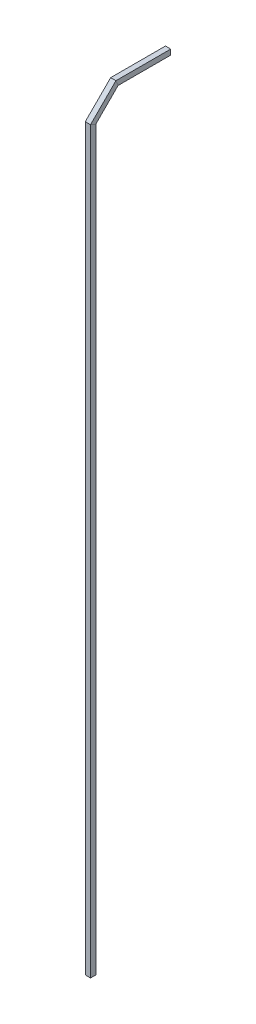
ISO-10303-21;
HEADER;
FILE_DESCRIPTION(('STEP AP214'),'2;1');
FILE_NAME('part.step','',(''),(''),'','','');
FILE_SCHEMA(('AUTOMOTIVE_DESIGN { 1 0 10303 214 1 1 1 1 }'));
ENDSEC;
DATA;
#1=APPLICATION_CONTEXT('core data for automotive mechanical design processes');
#2=APPLICATION_PROTOCOL_DEFINITION('international standard','automotive_design',2000,#1);
#3=PRODUCT_CONTEXT('',#1,'mechanical');
#4=PRODUCT('Part','Part','',(#3));
#5=PRODUCT_RELATED_PRODUCT_CATEGORY('part','',(#4));
#6=PRODUCT_DEFINITION_FORMATION('','',#4);
#7=PRODUCT_DEFINITION_CONTEXT('part definition',#1,'design');
#8=PRODUCT_DEFINITION('design','',#6,#7);
#9=PRODUCT_DEFINITION_SHAPE('','',#8);
#10=(LENGTH_UNIT() NAMED_UNIT(*) SI_UNIT(.MILLI.,.METRE.));
#11=(NAMED_UNIT(*) PLANE_ANGLE_UNIT() SI_UNIT($,.RADIAN.));
#12=(NAMED_UNIT(*) SI_UNIT($,.STERADIAN.) SOLID_ANGLE_UNIT());
#13=UNCERTAINTY_MEASURE_WITH_UNIT(LENGTH_MEASURE(1.E-05),#10,'distance_accuracy_value','');
#14=(GEOMETRIC_REPRESENTATION_CONTEXT(3) GLOBAL_UNCERTAINTY_ASSIGNED_CONTEXT((#13)) GLOBAL_UNIT_ASSIGNED_CONTEXT((#10,
#11,#12)) REPRESENTATION_CONTEXT('',''));
#15=CARTESIAN_POINT('',(0.,0.,0.));
#16=DIRECTION('',(0.,0.,1.));
#17=DIRECTION('',(1.,0.,0.));
#18=AXIS2_PLACEMENT_3D('',#15,#16,#17);
#19=CARTESIAN_POINT('',(0.,1447.42640687119,-147.426406871193));
#20=DIRECTION('',(0.,0.,-1.));
#21=DIRECTION('',(0.,1.,0.));
#22=AXIS2_PLACEMENT_3D('',#19,#20,#21);
#23=PLANE('',#22);
#24=DIRECTION('',(0.,1.,0.));
#25=VECTOR('',#24,1.);
#26=CARTESIAN_POINT('',(-5.,1442.42640687119,-147.426406871193));
#27=LINE('',#26,#25);
#28=CARTESIAN_POINT('',(-5.,1442.42640687119,-147.426406871193));
#29=VERTEX_POINT('',#28);
#30=CARTESIAN_POINT('',(-5.,1452.42640687119,-147.426406871193));
#31=VERTEX_POINT('',#30);
#32=EDGE_CURVE('E80',#29,#31,#27,.T.);
#33=ORIENTED_EDGE('',*,*,#32,.T.);
#34=DIRECTION('',(1.,0.,0.));
#35=VECTOR('',#34,1.);
#36=CARTESIAN_POINT('',(-5.,1452.42640687119,-147.426406871193));
#37=LINE('',#36,#35);
#38=CARTESIAN_POINT('',(5.,1452.42640687119,-147.426406871193));
#39=VERTEX_POINT('',#38);
#40=EDGE_CURVE('E99',#31,#39,#37,.T.);
#41=ORIENTED_EDGE('',*,*,#40,.T.);
#42=DIRECTION('',(0.,-1.,0.));
#43=VECTOR('',#42,1.);
#44=CARTESIAN_POINT('',(5.,1442.42640687119,-147.426406871193));
#45=LINE('',#44,#43);
#46=CARTESIAN_POINT('',(5.,1442.42640687119,-147.426406871193));
#47=VERTEX_POINT('',#46);
#48=EDGE_CURVE('E85',#39,#47,#45,.T.);
#49=ORIENTED_EDGE('',*,*,#48,.T.);
#50=DIRECTION('',(-1.,0.,0.));
#51=VECTOR('',#50,1.);
#52=CARTESIAN_POINT('',(-5.,1442.42640687119,-147.426406871193));
#53=LINE('',#52,#51);
#54=EDGE_CURVE('E83',#47,#29,#53,.T.);
#55=ORIENTED_EDGE('',*,*,#54,.T.);
#56=EDGE_LOOP('',(#33,#41,#49,#55));
#57=FACE_BOUND('',#56,.T.);
#58=ADVANCED_FACE('F34',(#57),#23,.T.);
#59=CARTESIAN_POINT('',(0.,0.,0.));
#60=DIRECTION('',(0.,1.,0.));
#61=DIRECTION('',(0.,0.,1.));
#62=AXIS2_PLACEMENT_3D('',#59,#60,#61);
#63=PLANE('',#62);
#64=DIRECTION('',(0.,0.,1.));
#65=VECTOR('',#64,1.);
#66=CARTESIAN_POINT('',(-5.,0.,-5.));
#67=LINE('',#66,#65);
#68=CARTESIAN_POINT('',(-5.,0.,-5.));
#69=VERTEX_POINT('',#68);
#70=CARTESIAN_POINT('',(-5.,0.,5.));
#71=VERTEX_POINT('',#70);
#72=EDGE_CURVE('E131',#69,#71,#67,.T.);
#73=ORIENTED_EDGE('',*,*,#72,.F.);
#74=DIRECTION('',(-1.,0.,0.));
#75=VECTOR('',#74,1.);
#76=CARTESIAN_POINT('',(-5.,0.,-5.));
#77=LINE('',#76,#75);
#78=CARTESIAN_POINT('',(5.,0.,-5.));
#79=VERTEX_POINT('',#78);
#80=EDGE_CURVE('E137',#79,#69,#77,.T.);
#81=ORIENTED_EDGE('',*,*,#80,.F.);
#82=DIRECTION('',(0.,0.,-1.));
#83=VECTOR('',#82,1.);
#84=CARTESIAN_POINT('',(5.,0.,-5.));
#85=LINE('',#84,#83);
#86=CARTESIAN_POINT('',(5.,0.,5.));
#87=VERTEX_POINT('',#86);
#88=EDGE_CURVE('E141',#87,#79,#85,.T.);
#89=ORIENTED_EDGE('',*,*,#88,.F.);
#90=DIRECTION('',(1.,0.,0.));
#91=VECTOR('',#90,1.);
#92=CARTESIAN_POINT('',(-5.,0.,5.));
#93=LINE('',#92,#91);
#94=EDGE_CURVE('E147',#71,#87,#93,.T.);
#95=ORIENTED_EDGE('',*,*,#94,.F.);
#96=EDGE_LOOP('',(#73,#81,#89,#95));
#97=FACE_BOUND('',#96,.T.);
#98=ADVANCED_FACE('F180',(#97),#63,.F.);
#99=CARTESIAN_POINT('',(-5.,1442.42640687119,-42.7700576850888));
#100=DIRECTION('',(-1.,0.,0.));
#101=DIRECTION('',(0.,-1.,0.));
#102=AXIS2_PLACEMENT_3D('',#99,#100,#101);
#103=PLANE('',#102);
#104=DIRECTION('',(0.,-0.923879532511286,-0.382683432365091));
#105=VECTOR('',#104,1.);
#106=CARTESIAN_POINT('',(-5.,1419.56693539306,-56.895109986115));
#107=LINE('',#106,#105);
#108=CARTESIAN_POINT('',(-5.,1452.42640687119,-43.2842712474618));
#109=VERTEX_POINT('',#108);
#110=CARTESIAN_POINT('',(-5.,1442.42640687119,-47.4264068711927));
#111=VERTEX_POINT('',#110);
#112=EDGE_CURVE('E115',#109,#111,#107,.T.);
#113=ORIENTED_EDGE('',*,*,#112,.F.);
#114=DIRECTION('',(0.,0.,-1.));
#115=VECTOR('',#114,1.);
#116=CARTESIAN_POINT('',(-5.,1452.42640687119,-42.7700576850888));
#117=LINE('',#116,#115);
#118=EDGE_CURVE('E97',#109,#31,#117,.T.);
#119=ORIENTED_EDGE('',*,*,#118,.T.);
#120=ORIENTED_EDGE('',*,*,#32,.F.);
#121=DIRECTION('',(0.,0.,-1.));
#122=VECTOR('',#121,1.);
#123=CARTESIAN_POINT('',(-5.,1442.42640687119,-42.7700576850888));
#124=LINE('',#123,#122);
#125=EDGE_CURVE('E37',#111,#29,#124,.T.);
#126=ORIENTED_EDGE('',*,*,#125,.F.);
#127=EDGE_LOOP('',(#113,#119,#120,#126));
#128=FACE_BOUND('',#127,.T.);
#129=ADVANCED_FACE('F94',(#128),#103,.T.);
#130=CARTESIAN_POINT('',(-5.,1452.42640687119,-42.7700576850888));
#131=DIRECTION('',(0.,1.,0.));
#132=DIRECTION('',(0.,0.,1.));
#133=AXIS2_PLACEMENT_3D('',#130,#131,#132);
#134=PLANE('',#133);
#135=DIRECTION('',(-1.,0.,0.));
#136=VECTOR('',#135,1.);
#137=CARTESIAN_POINT('',(-5.,1452.42640687119,-43.2842712474618));
#138=LINE('',#137,#136);
#139=CARTESIAN_POINT('',(5.,1452.42640687119,-43.2842712474618));
#140=VERTEX_POINT('',#139);
#141=EDGE_CURVE('E128',#140,#109,#138,.T.);
#142=ORIENTED_EDGE('',*,*,#141,.F.);
#143=DIRECTION('',(0.,0.,-1.));
#144=VECTOR('',#143,1.);
#145=CARTESIAN_POINT('',(5.,1452.42640687119,-42.7700576850888));
#146=LINE('',#145,#144);
#147=EDGE_CURVE('E108',#140,#39,#146,.T.);
#148=ORIENTED_EDGE('',*,*,#147,.T.);
#149=ORIENTED_EDGE('',*,*,#40,.F.);
#150=ORIENTED_EDGE('',*,*,#118,.F.);
#151=EDGE_LOOP('',(#142,#148,#149,#150));
#152=FACE_BOUND('',#151,.T.);
#153=ADVANCED_FACE('F200',(#152),#134,.T.);
#154=CARTESIAN_POINT('',(5.,1442.42640687119,-42.7700576850888));
#155=DIRECTION('',(1.,0.,0.));
#156=DIRECTION('',(0.,1.,0.));
#157=AXIS2_PLACEMENT_3D('',#154,#155,#156);
#158=PLANE('',#157);
#159=DIRECTION('',(0.,0.923879532511286,0.382683432365091));
#160=VECTOR('',#159,1.);
#161=CARTESIAN_POINT('',(4.99999999999999,1419.56693539306,-56.895109986115));
#162=LINE('',#161,#160);
#163=CARTESIAN_POINT('',(5.,1442.42640687119,-47.4264068711927));
#164=VERTEX_POINT('',#163);
#165=EDGE_CURVE('E125',#164,#140,#162,.T.);
#166=ORIENTED_EDGE('',*,*,#165,.F.);
#167=DIRECTION('',(0.,0.,-1.));
#168=VECTOR('',#167,1.);
#169=CARTESIAN_POINT('',(5.,1442.42640687119,-42.7700576850888));
#170=LINE('',#169,#168);
#171=EDGE_CURVE('E98',#164,#47,#170,.T.);
#172=ORIENTED_EDGE('',*,*,#171,.T.);
#173=ORIENTED_EDGE('',*,*,#48,.F.);
#174=ORIENTED_EDGE('',*,*,#147,.F.);
#175=EDGE_LOOP('',(#166,#172,#173,#174));
#176=FACE_BOUND('',#175,.T.);
#177=ADVANCED_FACE('F202',(#176),#158,.T.);
#178=CARTESIAN_POINT('',(-5.,1442.42640687119,-42.7700576850888));
#179=DIRECTION('',(0.,-1.,0.));
#180=DIRECTION('',(1.,0.,0.));
#181=AXIS2_PLACEMENT_3D('',#178,#179,#180);
#182=PLANE('',#181);
#183=DIRECTION('',(1.,0.,0.));
#184=VECTOR('',#183,1.);
#185=CARTESIAN_POINT('',(-5.,1442.42640687119,-47.4264068711927));
#186=LINE('',#185,#184);
#187=EDGE_CURVE('E103',#111,#164,#186,.T.);
#188=ORIENTED_EDGE('',*,*,#187,.F.);
#189=ORIENTED_EDGE('',*,*,#125,.T.);
#190=ORIENTED_EDGE('',*,*,#54,.F.);
#191=ORIENTED_EDGE('',*,*,#171,.F.);
#192=EDGE_LOOP('',(#188,#189,#190,#191));
#193=FACE_BOUND('',#192,.T.);
#194=ADVANCED_FACE('F101',(#193),#182,.T.);
#195=CARTESIAN_POINT('',(-5.,1396.70746391493,-1.70746391493347));
#196=DIRECTION('',(0.,-0.707106781186545,-0.70710678118655));
#197=DIRECTION('',(0.,0.70710678118655,-0.707106781186545));
#198=AXIS2_PLACEMENT_3D('',#195,#196,#197);
#199=PLANE('',#198);
#200=DIRECTION('',(0.,0.70710678118655,-0.707106781186545));
#201=VECTOR('',#200,1.);
#202=CARTESIAN_POINT('',(-5.,1396.70746391493,-1.70746391493347));
#203=LINE('',#202,#201);
#204=CARTESIAN_POINT('',(-5.,1400.,-4.99999999999996));
#205=VERTEX_POINT('',#204);
#206=EDGE_CURVE('E117',#205,#111,#203,.T.);
#207=ORIENTED_EDGE('',*,*,#206,.T.);
#208=ORIENTED_EDGE('',*,*,#187,.T.);
#209=DIRECTION('',(0.,0.70710678118655,-0.707106781186545));
#210=VECTOR('',#209,1.);
#211=CARTESIAN_POINT('',(5.,1396.70746391493,-1.70746391493347));
#212=LINE('',#211,#210);
#213=CARTESIAN_POINT('',(5.,1400.,-4.99999999999996));
#214=VERTEX_POINT('',#213);
#215=EDGE_CURVE('E104',#214,#164,#212,.T.);
#216=ORIENTED_EDGE('',*,*,#215,.F.);
#217=DIRECTION('',(1.,0.,0.));
#218=VECTOR('',#217,1.);
#219=CARTESIAN_POINT('',(-4.9999999999999,1400.,-5.));
#220=LINE('',#219,#218);
#221=EDGE_CURVE('E135',#205,#214,#220,.T.);
#222=ORIENTED_EDGE('',*,*,#221,.F.);
#223=EDGE_LOOP('',(#207,#208,#216,#222));
#224=FACE_BOUND('',#223,.T.);
#225=ADVANCED_FACE('F204',(#224),#199,.T.);
#226=CARTESIAN_POINT('',(5.,1396.70746391493,-1.70746391493347));
#227=DIRECTION('',(1.,0.,0.));
#228=DIRECTION('',(0.,0.,-1.));
#229=AXIS2_PLACEMENT_3D('',#226,#227,#228);
#230=PLANE('',#229);
#231=ORIENTED_EDGE('',*,*,#215,.T.);
#232=ORIENTED_EDGE('',*,*,#165,.T.);
#233=DIRECTION('',(0.,0.70710678118655,-0.707106781186545));
#234=VECTOR('',#233,1.);
#235=CARTESIAN_POINT('',(5.,1403.7785317268,5.36360389693203));
#236=LINE('',#235,#234);
#237=CARTESIAN_POINT('',(5.,1404.14213562373,4.99999999999997));
#238=VERTEX_POINT('',#237);
#239=EDGE_CURVE('E106',#238,#140,#236,.T.);
#240=ORIENTED_EDGE('',*,*,#239,.F.);
#241=DIRECTION('',(0.,0.382683432365088,0.923879532511288));
#242=VECTOR('',#241,1.);
#243=CARTESIAN_POINT('',(4.99999999999991,1194.97474683058,-499.974746830582));
#244=LINE('',#243,#242);
#245=EDGE_CURVE('E43',#214,#238,#244,.T.);
#246=ORIENTED_EDGE('',*,*,#245,.F.);
#247=EDGE_LOOP('',(#231,#232,#240,#246));
#248=FACE_BOUND('',#247,.T.);
#249=ADVANCED_FACE('F203',(#248),#230,.T.);
#250=CARTESIAN_POINT('',(-5.,1403.7785317268,5.36360389693203));
#251=DIRECTION('',(0.,0.707106781186545,0.70710678118655));
#252=DIRECTION('',(0.,-0.70710678118655,0.707106781186545));
#253=AXIS2_PLACEMENT_3D('',#250,#251,#252);
#254=PLANE('',#253);
#255=ORIENTED_EDGE('',*,*,#239,.T.);
#256=ORIENTED_EDGE('',*,*,#141,.T.);
#257=DIRECTION('',(0.,0.70710678118655,-0.707106781186545));
#258=VECTOR('',#257,1.);
#259=CARTESIAN_POINT('',(-5.,1403.7785317268,5.36360389693203));
#260=LINE('',#259,#258);
#261=CARTESIAN_POINT('',(-5.,1404.14213562373,4.99999999999994));
#262=VERTEX_POINT('',#261);
#263=EDGE_CURVE('E120',#262,#109,#260,.T.);
#264=ORIENTED_EDGE('',*,*,#263,.F.);
#265=DIRECTION('',(-1.,0.,0.));
#266=VECTOR('',#265,1.);
#267=CARTESIAN_POINT('',(-5.,1404.14213562373,5.));
#268=LINE('',#267,#266);
#269=EDGE_CURVE('E11',#238,#262,#268,.T.);
#270=ORIENTED_EDGE('',*,*,#269,.F.);
#271=EDGE_LOOP('',(#255,#256,#264,#270));
#272=FACE_BOUND('',#271,.T.);
#273=ADVANCED_FACE('F197',(#272),#254,.T.);
#274=CARTESIAN_POINT('',(-5.,1396.70746391493,-1.70746391493347));
#275=DIRECTION('',(-1.,0.,0.));
#276=DIRECTION('',(0.,0.,1.));
#277=AXIS2_PLACEMENT_3D('',#274,#275,#276);
#278=PLANE('',#277);
#279=ORIENTED_EDGE('',*,*,#263,.T.);
#280=ORIENTED_EDGE('',*,*,#112,.T.);
#281=ORIENTED_EDGE('',*,*,#206,.F.);
#282=DIRECTION('',(0.,-0.382683432365088,-0.923879532511288));
#283=VECTOR('',#282,1.);
#284=CARTESIAN_POINT('',(-5.00000000000004,1194.97474683058,-499.974746830582));
#285=LINE('',#284,#283);
#286=EDGE_CURVE('E132',#262,#205,#285,.T.);
#287=ORIENTED_EDGE('',*,*,#286,.F.);
#288=EDGE_LOOP('',(#279,#280,#281,#287));
#289=FACE_BOUND('',#288,.T.);
#290=ADVANCED_FACE('F196',(#289),#278,.T.);
#291=CARTESIAN_POINT('',(-5.,0.,-5.));
#292=DIRECTION('',(0.,0.,-1.));
#293=DIRECTION('',(-1.,0.,0.));
#294=AXIS2_PLACEMENT_3D('',#291,#292,#293);
#295=PLANE('',#294);
#296=DIRECTION('',(0.,1.,0.));
#297=VECTOR('',#296,1.);
#298=CARTESIAN_POINT('',(-5.,0.,-5.));
#299=LINE('',#298,#297);
#300=EDGE_CURVE('E140',#69,#205,#299,.T.);
#301=ORIENTED_EDGE('',*,*,#300,.T.);
#302=ORIENTED_EDGE('',*,*,#221,.T.);
#303=DIRECTION('',(0.,1.,0.));
#304=VECTOR('',#303,1.);
#305=CARTESIAN_POINT('',(5.,0.,-5.));
#306=LINE('',#305,#304);
#307=EDGE_CURVE('E136',#79,#214,#306,.T.);
#308=ORIENTED_EDGE('',*,*,#307,.F.);
#309=ORIENTED_EDGE('',*,*,#80,.T.);
#310=EDGE_LOOP('',(#301,#302,#308,#309));
#311=FACE_BOUND('',#310,.T.);
#312=ADVANCED_FACE('F189',(#311),#295,.T.);
#313=CARTESIAN_POINT('',(5.,0.,-5.));
#314=DIRECTION('',(1.,0.,0.));
#315=DIRECTION('',(0.,0.,-1.));
#316=AXIS2_PLACEMENT_3D('',#313,#314,#315);
#317=PLANE('',#316);
#318=ORIENTED_EDGE('',*,*,#307,.T.);
#319=ORIENTED_EDGE('',*,*,#245,.T.);
#320=DIRECTION('',(0.,1.,0.));
#321=VECTOR('',#320,1.);
#322=CARTESIAN_POINT('',(5.,0.,5.));
#323=LINE('',#322,#321);
#324=EDGE_CURVE('E144',#87,#238,#323,.T.);
#325=ORIENTED_EDGE('',*,*,#324,.F.);
#326=ORIENTED_EDGE('',*,*,#88,.T.);
#327=EDGE_LOOP('',(#318,#319,#325,#326));
#328=FACE_BOUND('',#327,.T.);
#329=ADVANCED_FACE('F164',(#328),#317,.T.);
#330=CARTESIAN_POINT('',(-5.,0.,5.));
#331=DIRECTION('',(0.,0.,1.));
#332=DIRECTION('',(1.,0.,0.));
#333=AXIS2_PLACEMENT_3D('',#330,#331,#332);
#334=PLANE('',#333);
#335=ORIENTED_EDGE('',*,*,#324,.T.);
#336=ORIENTED_EDGE('',*,*,#269,.T.);
#337=DIRECTION('',(0.,1.,0.));
#338=VECTOR('',#337,1.);
#339=CARTESIAN_POINT('',(-5.,0.,5.));
#340=LINE('',#339,#338);
#341=EDGE_CURVE('E150',#71,#262,#340,.T.);
#342=ORIENTED_EDGE('',*,*,#341,.F.);
#343=ORIENTED_EDGE('',*,*,#94,.T.);
#344=EDGE_LOOP('',(#335,#336,#342,#343));
#345=FACE_BOUND('',#344,.T.);
#346=ADVANCED_FACE('F170',(#345),#334,.T.);
#347=CARTESIAN_POINT('',(-5.,0.,-5.));
#348=DIRECTION('',(-1.,0.,0.));
#349=DIRECTION('',(0.,0.,1.));
#350=AXIS2_PLACEMENT_3D('',#347,#348,#349);
#351=PLANE('',#350);
#352=ORIENTED_EDGE('',*,*,#341,.T.);
#353=ORIENTED_EDGE('',*,*,#286,.T.);
#354=ORIENTED_EDGE('',*,*,#300,.F.);
#355=ORIENTED_EDGE('',*,*,#72,.T.);
#356=EDGE_LOOP('',(#352,#353,#354,#355));
#357=FACE_BOUND('',#356,.T.);
#358=ADVANCED_FACE('F185',(#357),#351,.T.);
#359=CLOSED_SHELL('',(#58,#98,#129,#153,#177,#194,#225,#249,#273,#290,#312,#329,#346,#358));
#360=MANIFOLD_SOLID_BREP('B2',#359);
#361=ADVANCED_BREP_SHAPE_REPRESENTATION('',(#18,#360),#14);
#362=SHAPE_DEFINITION_REPRESENTATION(#9,#361);
ENDSEC;
END-ISO-10303-21;
